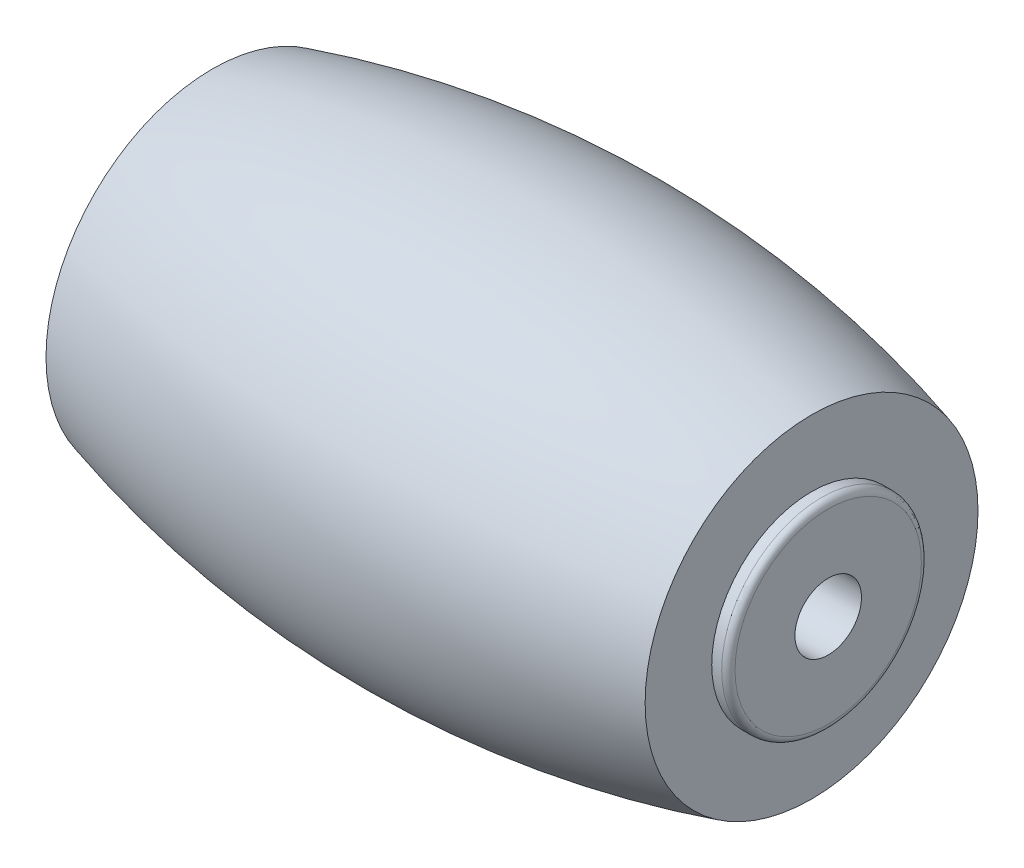
ISO-10303-21;
HEADER;
FILE_DESCRIPTION(('STEP AP214'),'2;1');
FILE_NAME('part.step','',(''),(''),'','','');
FILE_SCHEMA(('AUTOMOTIVE_DESIGN { 1 0 10303 214 1 1 1 1 }'));
ENDSEC;
DATA;
#1=APPLICATION_CONTEXT('core data for automotive mechanical design processes');
#2=APPLICATION_PROTOCOL_DEFINITION('international standard','automotive_design',2000,#1);
#3=PRODUCT_CONTEXT('',#1,'mechanical');
#4=PRODUCT('Part','Part','',(#3));
#5=PRODUCT_RELATED_PRODUCT_CATEGORY('part','',(#4));
#6=PRODUCT_DEFINITION_FORMATION('','',#4);
#7=PRODUCT_DEFINITION_CONTEXT('part definition',#1,'design');
#8=PRODUCT_DEFINITION('design','',#6,#7);
#9=PRODUCT_DEFINITION_SHAPE('','',#8);
#10=(LENGTH_UNIT() NAMED_UNIT(*) SI_UNIT(.MILLI.,.METRE.));
#11=(NAMED_UNIT(*) PLANE_ANGLE_UNIT() SI_UNIT($,.RADIAN.));
#12=(NAMED_UNIT(*) SI_UNIT($,.STERADIAN.) SOLID_ANGLE_UNIT());
#13=UNCERTAINTY_MEASURE_WITH_UNIT(LENGTH_MEASURE(1.E-05),#10,'distance_accuracy_value','');
#14=(GEOMETRIC_REPRESENTATION_CONTEXT(3) GLOBAL_UNCERTAINTY_ASSIGNED_CONTEXT((#13)) GLOBAL_UNIT_ASSIGNED_CONTEXT((#10,
#11,#12)) REPRESENTATION_CONTEXT('',''));
#15=CARTESIAN_POINT('',(0.,0.,0.));
#16=DIRECTION('',(0.,0.,1.));
#17=DIRECTION('',(1.,0.,0.));
#18=AXIS2_PLACEMENT_3D('',#15,#16,#17);
#19=CARTESIAN_POINT('',(8.99999999999999,0.,0.));
#20=DIRECTION('',(1.,0.,0.));
#21=DIRECTION('',(0.,0.,-1.));
#22=AXIS2_PLACEMENT_3D('',#19,#20,#21);
#23=PLANE('',#22);
#24=CARTESIAN_POINT('',(8.99999999999999,0.,0.));
#25=DIRECTION('',(1.,0.,0.));
#26=DIRECTION('',(0.,0.,-1.));
#27=AXIS2_PLACEMENT_3D('',#24,#25,#26);
#28=CIRCLE('',#27,3.);
#29=CARTESIAN_POINT('',(8.99999999999999,0.,-3.));
#30=VERTEX_POINT('',#29);
#31=EDGE_CURVE('E50',#30,#30,#28,.T.);
#32=ORIENTED_EDGE('',*,*,#31,.F.);
#33=EDGE_LOOP('',(#32));
#34=FACE_BOUND('',#33,.T.);
#35=CARTESIAN_POINT('',(8.99999999999998,0.,0.));
#36=DIRECTION('',(1.,0.,0.));
#37=DIRECTION('',(0.,0.,-1.));
#38=AXIS2_PLACEMENT_3D('',#35,#36,#37);
#39=CIRCLE('',#38,5.);
#40=CARTESIAN_POINT('',(8.99999999999998,0.,-5.));
#41=VERTEX_POINT('',#40);
#42=EDGE_CURVE('E54',#41,#41,#39,.T.);
#43=ORIENTED_EDGE('',*,*,#42,.T.);
#44=EDGE_LOOP('',(#43));
#45=FACE_BOUND('',#44,.T.);
#46=ADVANCED_FACE('F30',(#34,#45),#23,.T.);
#47=CARTESIAN_POINT('',(-9.,0.,0.));
#48=DIRECTION('',(-1.,0.,0.));
#49=DIRECTION('',(0.,0.,1.));
#50=AXIS2_PLACEMENT_3D('',#47,#48,#49);
#51=PLANE('',#50);
#52=CARTESIAN_POINT('',(-8.99999999999999,0.,0.));
#53=DIRECTION('',(1.,0.,0.));
#54=DIRECTION('',(0.,0.,-1.));
#55=AXIS2_PLACEMENT_3D('',#52,#53,#54);
#56=CIRCLE('',#55,3.);
#57=CARTESIAN_POINT('',(-8.99999999999999,0.,-3.));
#58=VERTEX_POINT('',#57);
#59=EDGE_CURVE('E57',#58,#58,#56,.T.);
#60=ORIENTED_EDGE('',*,*,#59,.T.);
#61=EDGE_LOOP('',(#60));
#62=FACE_BOUND('',#61,.T.);
#63=CARTESIAN_POINT('',(-9.,0.,0.));
#64=DIRECTION('',(1.,0.,0.));
#65=DIRECTION('',(0.,0.,-1.));
#66=AXIS2_PLACEMENT_3D('',#63,#64,#65);
#67=CIRCLE('',#66,5.);
#68=CARTESIAN_POINT('',(-9.,0.,-5.));
#69=VERTEX_POINT('',#68);
#70=EDGE_CURVE('E51',#69,#69,#67,.T.);
#71=ORIENTED_EDGE('',*,*,#70,.F.);
#72=EDGE_LOOP('',(#71));
#73=FACE_BOUND('',#72,.T.);
#74=ADVANCED_FACE('F87',(#62,#73),#51,.T.);
#75=CARTESIAN_POINT('',(0.,0.,0.));
#76=DIRECTION('',(1.,0.,0.));
#77=DIRECTION('',(0.,0.,-1.));
#78=AXIS2_PLACEMENT_3D('',#75,#76,#77);
#79=DEGENERATE_TOROIDAL_SURFACE('',#78,26.7836447571631,33.0333176361313,.F.);
#80=ORIENTED_EDGE('',*,*,#70,.T.);
#81=EDGE_LOOP('',(#80));
#82=FACE_BOUND('',#81,.T.);
#83=ORIENTED_EDGE('',*,*,#42,.F.);
#84=EDGE_LOOP('',(#83));
#85=FACE_BOUND('',#84,.T.);
#86=ADVANCED_FACE('F93',(#82,#85),#79,.F.);
#87=CARTESIAN_POINT('',(9.49999999999999,0.,0.));
#88=DIRECTION('',(-1.,0.,0.));
#89=DIRECTION('',(0.,0.,1.));
#90=AXIS2_PLACEMENT_3D('',#87,#88,#89);
#91=CYLINDRICAL_SURFACE('',#90,3.);
#92=CARTESIAN_POINT('',(9.29999999999999,0.,0.));
#93=DIRECTION('',(1.,0.,0.));
#94=DIRECTION('',(0.,0.,-1.));
#95=AXIS2_PLACEMENT_3D('',#92,#93,#94);
#96=CIRCLE('',#95,3.);
#97=CARTESIAN_POINT('',(9.29999999999999,0.,-3.));
#98=VERTEX_POINT('',#97);
#99=EDGE_CURVE('E41',#98,#98,#96,.F.);
#100=ORIENTED_EDGE('',*,*,#99,.T.);
#101=EDGE_LOOP('',(#100));
#102=FACE_BOUND('',#101,.T.);
#103=ORIENTED_EDGE('',*,*,#31,.T.);
#104=EDGE_LOOP('',(#103));
#105=FACE_BOUND('',#104,.T.);
#106=ADVANCED_FACE('F110',(#102,#105),#91,.T.);
#107=CARTESIAN_POINT('',(9.49999999999999,0.,0.));
#108=DIRECTION('',(1.,0.,0.));
#109=DIRECTION('',(0.,0.,-1.));
#110=AXIS2_PLACEMENT_3D('',#107,#108,#109);
#111=PLANE('',#110);
#112=CARTESIAN_POINT('',(9.49999999999999,0.,0.));
#113=DIRECTION('',(1.,0.,0.));
#114=DIRECTION('',(0.,0.,-1.));
#115=AXIS2_PLACEMENT_3D('',#112,#113,#114);
#116=CIRCLE('',#115,2.8);
#117=CARTESIAN_POINT('',(9.49999999999999,0.,-2.8));
#118=VERTEX_POINT('',#117);
#119=EDGE_CURVE('E45',#118,#118,#116,.T.);
#120=ORIENTED_EDGE('',*,*,#119,.T.);
#121=EDGE_LOOP('',(#120));
#122=FACE_BOUND('',#121,.T.);
#123=CARTESIAN_POINT('',(9.49999999999999,0.,0.));
#124=DIRECTION('',(-1.,0.,0.));
#125=DIRECTION('',(0.,0.,1.));
#126=AXIS2_PLACEMENT_3D('',#123,#124,#125);
#127=CIRCLE('',#126,1.);
#128=CARTESIAN_POINT('',(9.49999999999999,0.,1.));
#129=VERTEX_POINT('',#128);
#130=EDGE_CURVE('E62',#129,#129,#127,.T.);
#131=ORIENTED_EDGE('',*,*,#130,.T.);
#132=EDGE_LOOP('',(#131));
#133=FACE_BOUND('',#132,.T.);
#134=ADVANCED_FACE('F69',(#122,#133),#111,.T.);
#135=CARTESIAN_POINT('',(-9.49999999999999,0.,0.));
#136=DIRECTION('',(1.,0.,0.));
#137=DIRECTION('',(0.,0.,-1.));
#138=AXIS2_PLACEMENT_3D('',#135,#136,#137);
#139=CYLINDRICAL_SURFACE('',#138,3.);
#140=CARTESIAN_POINT('',(-9.29999999999999,0.,0.));
#141=DIRECTION('',(-1.,0.,0.));
#142=DIRECTION('',(0.,0.,1.));
#143=AXIS2_PLACEMENT_3D('',#140,#141,#142);
#144=CIRCLE('',#143,3.);
#145=CARTESIAN_POINT('',(-9.29999999999999,0.,3.));
#146=VERTEX_POINT('',#145);
#147=EDGE_CURVE('E37',#146,#146,#144,.F.);
#148=ORIENTED_EDGE('',*,*,#147,.T.);
#149=EDGE_LOOP('',(#148));
#150=FACE_BOUND('',#149,.T.);
#151=ORIENTED_EDGE('',*,*,#59,.F.);
#152=EDGE_LOOP('',(#151));
#153=FACE_BOUND('',#152,.T.);
#154=ADVANCED_FACE('F80',(#150,#153),#139,.T.);
#155=CARTESIAN_POINT('',(-9.49999999999999,0.,0.));
#156=DIRECTION('',(-1.,0.,0.));
#157=DIRECTION('',(0.,0.,-1.));
#158=AXIS2_PLACEMENT_3D('',#155,#156,#157);
#159=PLANE('',#158);
#160=CARTESIAN_POINT('',(-9.49999999999999,0.,0.));
#161=DIRECTION('',(-1.,0.,0.));
#162=DIRECTION('',(0.,0.,1.));
#163=AXIS2_PLACEMENT_3D('',#160,#161,#162);
#164=CIRCLE('',#163,2.8);
#165=CARTESIAN_POINT('',(-9.49999999999999,0.,2.8));
#166=VERTEX_POINT('',#165);
#167=EDGE_CURVE('E10',#166,#166,#164,.T.);
#168=ORIENTED_EDGE('',*,*,#167,.T.);
#169=EDGE_LOOP('',(#168));
#170=FACE_BOUND('',#169,.T.);
#171=CARTESIAN_POINT('',(-9.49999999999999,0.,0.));
#172=DIRECTION('',(-1.,0.,0.));
#173=DIRECTION('',(0.,0.,1.));
#174=AXIS2_PLACEMENT_3D('',#171,#172,#173);
#175=CIRCLE('',#174,1.);
#176=CARTESIAN_POINT('',(-9.49999999999999,0.,1.));
#177=VERTEX_POINT('',#176);
#178=EDGE_CURVE('E63',#177,#177,#175,.T.);
#179=ORIENTED_EDGE('',*,*,#178,.F.);
#180=EDGE_LOOP('',(#179));
#181=FACE_BOUND('',#180,.T.);
#182=ADVANCED_FACE('F75',(#170,#181),#159,.T.);
#183=CARTESIAN_POINT('',(9.49999999999999,0.,0.));
#184=DIRECTION('',(-1.,0.,0.));
#185=DIRECTION('',(0.,0.,1.));
#186=AXIS2_PLACEMENT_3D('',#183,#184,#185);
#187=CYLINDRICAL_SURFACE('',#186,1.);
#188=ORIENTED_EDGE('',*,*,#130,.F.);
#189=EDGE_LOOP('',(#188));
#190=FACE_BOUND('',#189,.T.);
#191=ORIENTED_EDGE('',*,*,#178,.T.);
#192=EDGE_LOOP('',(#191));
#193=FACE_BOUND('',#192,.T.);
#194=ADVANCED_FACE('F71',(#190,#193),#187,.F.);
#195=CARTESIAN_POINT('',(9.29999999999999,0.,0.));
#196=DIRECTION('',(1.,0.,0.));
#197=DIRECTION('',(0.,0.,-1.));
#198=AXIS2_PLACEMENT_3D('',#195,#196,#197);
#199=TOROIDAL_SURFACE('',#198,2.8,0.2);
#200=ORIENTED_EDGE('',*,*,#99,.F.);
#201=EDGE_LOOP('',(#200));
#202=FACE_BOUND('',#201,.T.);
#203=ORIENTED_EDGE('',*,*,#119,.F.);
#204=EDGE_LOOP('',(#203));
#205=FACE_BOUND('',#204,.T.);
#206=ADVANCED_FACE('F74',(#202,#205),#199,.T.);
#207=CARTESIAN_POINT('',(-9.29999999999999,0.,0.));
#208=DIRECTION('',(-1.,0.,0.));
#209=DIRECTION('',(0.,0.,1.));
#210=AXIS2_PLACEMENT_3D('',#207,#208,#209);
#211=TOROIDAL_SURFACE('',#210,2.8,0.2);
#212=ORIENTED_EDGE('',*,*,#167,.F.);
#213=EDGE_LOOP('',(#212));
#214=FACE_BOUND('',#213,.T.);
#215=ORIENTED_EDGE('',*,*,#147,.F.);
#216=EDGE_LOOP('',(#215));
#217=FACE_BOUND('',#216,.T.);
#218=ADVANCED_FACE('F32',(#214,#217),#211,.T.);
#219=CLOSED_SHELL('',(#46,#74,#86,#106,#134,#154,#182,#194,#206,#218));
#220=MANIFOLD_SOLID_BREP('B2',#219);
#221=ADVANCED_BREP_SHAPE_REPRESENTATION('',(#18,#220),#14);
#222=SHAPE_DEFINITION_REPRESENTATION(#9,#221);
ENDSEC;
END-ISO-10303-21;
